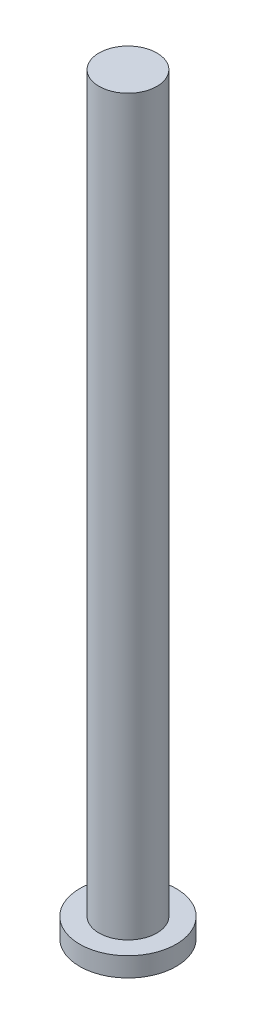
ISO-10303-21;
HEADER;
FILE_DESCRIPTION(('STEP AP214'),'2;1');
FILE_NAME('part.step','',(''),(''),'','','');
FILE_SCHEMA(('AUTOMOTIVE_DESIGN { 1 0 10303 214 1 1 1 1 }'));
ENDSEC;
DATA;
#1=APPLICATION_CONTEXT('core data for automotive mechanical design processes');
#2=APPLICATION_PROTOCOL_DEFINITION('international standard','automotive_design',2000,#1);
#3=PRODUCT_CONTEXT('',#1,'mechanical');
#4=PRODUCT('Part','Part','',(#3));
#5=PRODUCT_RELATED_PRODUCT_CATEGORY('part','',(#4));
#6=PRODUCT_DEFINITION_FORMATION('','',#4);
#7=PRODUCT_DEFINITION_CONTEXT('part definition',#1,'design');
#8=PRODUCT_DEFINITION('design','',#6,#7);
#9=PRODUCT_DEFINITION_SHAPE('','',#8);
#10=(LENGTH_UNIT() NAMED_UNIT(*) SI_UNIT(.MILLI.,.METRE.));
#11=(NAMED_UNIT(*) PLANE_ANGLE_UNIT() SI_UNIT($,.RADIAN.));
#12=(NAMED_UNIT(*) SI_UNIT($,.STERADIAN.) SOLID_ANGLE_UNIT());
#13=UNCERTAINTY_MEASURE_WITH_UNIT(LENGTH_MEASURE(1.E-05),#10,'distance_accuracy_value','');
#14=(GEOMETRIC_REPRESENTATION_CONTEXT(3) GLOBAL_UNCERTAINTY_ASSIGNED_CONTEXT((#13)) GLOBAL_UNIT_ASSIGNED_CONTEXT((#10,
#11,#12)) REPRESENTATION_CONTEXT('',''));
#15=CARTESIAN_POINT('',(0.,0.,0.));
#16=DIRECTION('',(0.,0.,1.));
#17=DIRECTION('',(1.,0.,0.));
#18=AXIS2_PLACEMENT_3D('',#15,#16,#17);
#19=CARTESIAN_POINT('',(0.,1.,0.));
#20=DIRECTION('',(0.,1.,0.));
#21=DIRECTION('',(0.,0.,1.));
#22=AXIS2_PLACEMENT_3D('',#19,#20,#21);
#23=PLANE('',#22);
#24=CARTESIAN_POINT('',(0.,1.,0.));
#25=DIRECTION('',(0.,1.,0.));
#26=DIRECTION('',(0.,0.,1.));
#27=AXIS2_PLACEMENT_3D('',#24,#25,#26);
#28=CIRCLE('',#27,2.5);
#29=CARTESIAN_POINT('',(0.,1.,2.5));
#30=VERTEX_POINT('',#29);
#31=EDGE_CURVE('E10',#30,#30,#28,.T.);
#32=ORIENTED_EDGE('',*,*,#31,.T.);
#33=EDGE_LOOP('',(#32));
#34=FACE_BOUND('',#33,.T.);
#35=CARTESIAN_POINT('',(0.,1.,0.));
#36=DIRECTION('',(0.,1.,0.));
#37=DIRECTION('',(0.,0.,1.));
#38=AXIS2_PLACEMENT_3D('',#35,#36,#37);
#39=CIRCLE('',#38,1.5);
#40=CARTESIAN_POINT('',(0.,1.,1.5));
#41=VERTEX_POINT('',#40);
#42=EDGE_CURVE('E44',#41,#41,#39,.T.);
#43=ORIENTED_EDGE('',*,*,#42,.F.);
#44=EDGE_LOOP('',(#43));
#45=FACE_BOUND('',#44,.T.);
#46=ADVANCED_FACE('F31',(#34,#45),#23,.T.);
#47=CARTESIAN_POINT('',(0.,1.,0.));
#48=DIRECTION('',(0.,-1.,0.));
#49=DIRECTION('',(0.,0.,-1.));
#50=AXIS2_PLACEMENT_3D('',#47,#48,#49);
#51=CYLINDRICAL_SURFACE('',#50,2.5);
#52=ORIENTED_EDGE('',*,*,#31,.F.);
#53=EDGE_LOOP('',(#52));
#54=FACE_BOUND('',#53,.T.);
#55=CARTESIAN_POINT('',(0.,0.,0.));
#56=DIRECTION('',(0.,1.,0.));
#57=DIRECTION('',(0.,0.,1.));
#58=AXIS2_PLACEMENT_3D('',#55,#56,#57);
#59=CIRCLE('',#58,2.5);
#60=CARTESIAN_POINT('',(0.,0.,2.5));
#61=VERTEX_POINT('',#60);
#62=EDGE_CURVE('E35',#61,#61,#59,.T.);
#63=ORIENTED_EDGE('',*,*,#62,.T.);
#64=EDGE_LOOP('',(#63));
#65=FACE_BOUND('',#64,.T.);
#66=ADVANCED_FACE('F33',(#54,#65),#51,.T.);
#67=CARTESIAN_POINT('',(0.,0.,0.));
#68=DIRECTION('',(0.,1.,0.));
#69=DIRECTION('',(0.,0.,1.));
#70=AXIS2_PLACEMENT_3D('',#67,#68,#69);
#71=PLANE('',#70);
#72=ORIENTED_EDGE('',*,*,#62,.F.);
#73=EDGE_LOOP('',(#72));
#74=FACE_BOUND('',#73,.T.);
#75=ADVANCED_FACE('F55',(#74),#71,.F.);
#76=CARTESIAN_POINT('',(0.,39.,0.));
#77=DIRECTION('',(0.,-1.,0.));
#78=DIRECTION('',(0.,0.,-1.));
#79=AXIS2_PLACEMENT_3D('',#76,#77,#78);
#80=CYLINDRICAL_SURFACE('',#79,1.5);
#81=CARTESIAN_POINT('',(0.,39.,0.));
#82=DIRECTION('',(0.,1.,0.));
#83=DIRECTION('',(0.,0.,1.));
#84=AXIS2_PLACEMENT_3D('',#81,#82,#83);
#85=CIRCLE('',#84,1.5);
#86=CARTESIAN_POINT('',(0.,39.,1.5));
#87=VERTEX_POINT('',#86);
#88=EDGE_CURVE('E42',#87,#87,#85,.T.);
#89=ORIENTED_EDGE('',*,*,#88,.F.);
#90=EDGE_LOOP('',(#89));
#91=FACE_BOUND('',#90,.T.);
#92=ORIENTED_EDGE('',*,*,#42,.T.);
#93=EDGE_LOOP('',(#92));
#94=FACE_BOUND('',#93,.T.);
#95=ADVANCED_FACE('F52',(#91,#94),#80,.T.);
#96=CARTESIAN_POINT('',(0.,39.,0.));
#97=DIRECTION('',(0.,1.,0.));
#98=DIRECTION('',(0.,0.,1.));
#99=AXIS2_PLACEMENT_3D('',#96,#97,#98);
#100=PLANE('',#99);
#101=ORIENTED_EDGE('',*,*,#88,.T.);
#102=EDGE_LOOP('',(#101));
#103=FACE_BOUND('',#102,.T.);
#104=ADVANCED_FACE('F50',(#103),#100,.T.);
#105=CLOSED_SHELL('',(#46,#66,#75,#95,#104));
#106=MANIFOLD_SOLID_BREP('B2',#105);
#107=ADVANCED_BREP_SHAPE_REPRESENTATION('',(#18,#106),#14);
#108=SHAPE_DEFINITION_REPRESENTATION(#9,#107);
ENDSEC;
END-ISO-10303-21;
